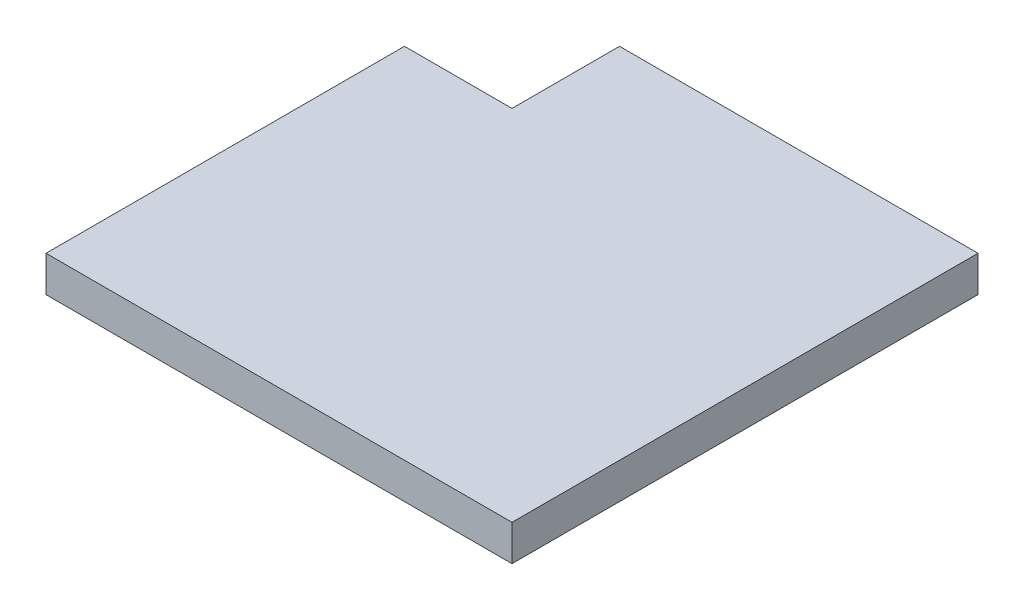
ISO-10303-21;
HEADER;
FILE_DESCRIPTION(('STEP AP214'),'2;1');
FILE_NAME('part.step','',(''),(''),'','','');
FILE_SCHEMA(('AUTOMOTIVE_DESIGN { 1 0 10303 214 1 1 1 1 }'));
ENDSEC;
DATA;
#1=APPLICATION_CONTEXT('core data for automotive mechanical design processes');
#2=APPLICATION_PROTOCOL_DEFINITION('international standard','automotive_design',2000,#1);
#3=PRODUCT_CONTEXT('',#1,'mechanical');
#4=PRODUCT('Part','Part','',(#3));
#5=PRODUCT_RELATED_PRODUCT_CATEGORY('part','',(#4));
#6=PRODUCT_DEFINITION_FORMATION('','',#4);
#7=PRODUCT_DEFINITION_CONTEXT('part definition',#1,'design');
#8=PRODUCT_DEFINITION('design','',#6,#7);
#9=PRODUCT_DEFINITION_SHAPE('','',#8);
#10=(LENGTH_UNIT() NAMED_UNIT(*) SI_UNIT(.MILLI.,.METRE.));
#11=(NAMED_UNIT(*) PLANE_ANGLE_UNIT() SI_UNIT($,.RADIAN.));
#12=(NAMED_UNIT(*) SI_UNIT($,.STERADIAN.) SOLID_ANGLE_UNIT());
#13=UNCERTAINTY_MEASURE_WITH_UNIT(LENGTH_MEASURE(1.E-05),#10,'distance_accuracy_value','');
#14=(GEOMETRIC_REPRESENTATION_CONTEXT(3) GLOBAL_UNCERTAINTY_ASSIGNED_CONTEXT((#13)) GLOBAL_UNIT_ASSIGNED_CONTEXT((#10,
#11,#12)) REPRESENTATION_CONTEXT('',''));
#15=CARTESIAN_POINT('',(0.,0.,0.));
#16=DIRECTION('',(0.,0.,1.));
#17=DIRECTION('',(1.,0.,0.));
#18=AXIS2_PLACEMENT_3D('',#15,#16,#17);
#19=CARTESIAN_POINT('',(65.,10.,65.));
#20=DIRECTION('',(-1.,0.,0.));
#21=DIRECTION('',(0.,0.,1.));
#22=AXIS2_PLACEMENT_3D('',#19,#20,#21);
#23=PLANE('',#22);
#24=DIRECTION('',(0.,0.,-1.));
#25=VECTOR('',#24,1.);
#26=CARTESIAN_POINT('',(65.,0.,65.));
#27=LINE('',#26,#25);
#28=CARTESIAN_POINT('',(65.,0.,65.));
#29=VERTEX_POINT('',#28);
#30=CARTESIAN_POINT('',(65.,0.,-65.));
#31=VERTEX_POINT('',#30);
#32=EDGE_CURVE('E118',#29,#31,#27,.T.);
#33=ORIENTED_EDGE('',*,*,#32,.T.);
#34=DIRECTION('',(0.,-1.,0.));
#35=VECTOR('',#34,1.);
#36=CARTESIAN_POINT('',(65.,10.,-65.));
#37=LINE('',#36,#35);
#38=CARTESIAN_POINT('',(65.,10.,-65.));
#39=VERTEX_POINT('',#38);
#40=EDGE_CURVE('E11',#39,#31,#37,.T.);
#41=ORIENTED_EDGE('',*,*,#40,.F.);
#42=DIRECTION('',(0.,0.,-1.));
#43=VECTOR('',#42,1.);
#44=CARTESIAN_POINT('',(65.,10.,65.));
#45=LINE('',#44,#43);
#46=CARTESIAN_POINT('',(65.,10.,65.));
#47=VERTEX_POINT('',#46);
#48=EDGE_CURVE('E128',#47,#39,#45,.T.);
#49=ORIENTED_EDGE('',*,*,#48,.F.);
#50=DIRECTION('',(0.,-1.,0.));
#51=VECTOR('',#50,1.);
#52=CARTESIAN_POINT('',(65.,10.,65.));
#53=LINE('',#52,#51);
#54=EDGE_CURVE('E114',#47,#29,#53,.T.);
#55=ORIENTED_EDGE('',*,*,#54,.T.);
#56=EDGE_LOOP('',(#33,#41,#49,#55));
#57=FACE_BOUND('',#56,.T.);
#58=ADVANCED_FACE('F34',(#57),#23,.F.);
#59=CARTESIAN_POINT('',(65.,10.,-65.));
#60=DIRECTION('',(0.,0.,1.));
#61=DIRECTION('',(1.,0.,0.));
#62=AXIS2_PLACEMENT_3D('',#59,#60,#61);
#63=PLANE('',#62);
#64=DIRECTION('',(-1.,0.,0.));
#65=VECTOR('',#64,1.);
#66=CARTESIAN_POINT('',(65.,0.,-65.));
#67=LINE('',#66,#65);
#68=CARTESIAN_POINT('',(-35.,0.,-65.));
#69=VERTEX_POINT('',#68);
#70=EDGE_CURVE('E121',#31,#69,#67,.T.);
#71=ORIENTED_EDGE('',*,*,#70,.T.);
#72=DIRECTION('',(0.,-1.,0.));
#73=VECTOR('',#72,1.);
#74=CARTESIAN_POINT('',(-35.,10.,-65.));
#75=LINE('',#74,#73);
#76=CARTESIAN_POINT('',(-35.,10.,-65.));
#77=VERTEX_POINT('',#76);
#78=EDGE_CURVE('E42',#77,#69,#75,.T.);
#79=ORIENTED_EDGE('',*,*,#78,.F.);
#80=DIRECTION('',(-1.,0.,0.));
#81=VECTOR('',#80,1.);
#82=CARTESIAN_POINT('',(65.,10.,-65.));
#83=LINE('',#82,#81);
#84=EDGE_CURVE('E87',#39,#77,#83,.T.);
#85=ORIENTED_EDGE('',*,*,#84,.F.);
#86=ORIENTED_EDGE('',*,*,#40,.T.);
#87=EDGE_LOOP('',(#71,#79,#85,#86));
#88=FACE_BOUND('',#87,.T.);
#89=ADVANCED_FACE('F152',(#88),#63,.F.);
#90=CARTESIAN_POINT('',(-35.,10.,-65.));
#91=DIRECTION('',(1.,0.,0.));
#92=DIRECTION('',(0.,0.,-1.));
#93=AXIS2_PLACEMENT_3D('',#90,#91,#92);
#94=PLANE('',#93);
#95=DIRECTION('',(0.,0.,1.));
#96=VECTOR('',#95,1.);
#97=CARTESIAN_POINT('',(-35.,0.,-65.));
#98=LINE('',#97,#96);
#99=CARTESIAN_POINT('',(-35.,0.,-35.));
#100=VERTEX_POINT('',#99);
#101=EDGE_CURVE('E123',#69,#100,#98,.T.);
#102=ORIENTED_EDGE('',*,*,#101,.T.);
#103=DIRECTION('',(0.,-1.,0.));
#104=VECTOR('',#103,1.);
#105=CARTESIAN_POINT('',(-35.,10.,-35.));
#106=LINE('',#105,#104);
#107=CARTESIAN_POINT('',(-35.,10.,-35.));
#108=VERTEX_POINT('',#107);
#109=EDGE_CURVE('E109',#108,#100,#106,.T.);
#110=ORIENTED_EDGE('',*,*,#109,.F.);
#111=DIRECTION('',(0.,0.,1.));
#112=VECTOR('',#111,1.);
#113=CARTESIAN_POINT('',(-35.,10.,-65.));
#114=LINE('',#113,#112);
#115=EDGE_CURVE('E100',#77,#108,#114,.T.);
#116=ORIENTED_EDGE('',*,*,#115,.F.);
#117=ORIENTED_EDGE('',*,*,#78,.T.);
#118=EDGE_LOOP('',(#102,#110,#116,#117));
#119=FACE_BOUND('',#118,.T.);
#120=ADVANCED_FACE('F134',(#119),#94,.F.);
#121=CARTESIAN_POINT('',(-35.,10.,-35.));
#122=DIRECTION('',(0.,0.,1.));
#123=DIRECTION('',(1.,0.,0.));
#124=AXIS2_PLACEMENT_3D('',#121,#122,#123);
#125=PLANE('',#124);
#126=DIRECTION('',(-1.,0.,0.));
#127=VECTOR('',#126,1.);
#128=CARTESIAN_POINT('',(-35.,0.,-35.));
#129=LINE('',#128,#127);
#130=CARTESIAN_POINT('',(-65.,0.,-35.));
#131=VERTEX_POINT('',#130);
#132=EDGE_CURVE('E108',#100,#131,#129,.T.);
#133=ORIENTED_EDGE('',*,*,#132,.T.);
#134=DIRECTION('',(0.,-1.,0.));
#135=VECTOR('',#134,1.);
#136=CARTESIAN_POINT('',(-65.,10.,-35.));
#137=LINE('',#136,#135);
#138=CARTESIAN_POINT('',(-65.,10.,-35.));
#139=VERTEX_POINT('',#138);
#140=EDGE_CURVE('E105',#139,#131,#137,.T.);
#141=ORIENTED_EDGE('',*,*,#140,.F.);
#142=DIRECTION('',(-1.,0.,0.));
#143=VECTOR('',#142,1.);
#144=CARTESIAN_POINT('',(-35.,10.,-35.));
#145=LINE('',#144,#143);
#146=EDGE_CURVE('E94',#108,#139,#145,.T.);
#147=ORIENTED_EDGE('',*,*,#146,.F.);
#148=ORIENTED_EDGE('',*,*,#109,.T.);
#149=EDGE_LOOP('',(#133,#141,#147,#148));
#150=FACE_BOUND('',#149,.T.);
#151=ADVANCED_FACE('F106',(#150),#125,.F.);
#152=CARTESIAN_POINT('',(-65.,10.,-35.));
#153=DIRECTION('',(1.,0.,0.));
#154=DIRECTION('',(0.,0.,-1.));
#155=AXIS2_PLACEMENT_3D('',#152,#153,#154);
#156=PLANE('',#155);
#157=DIRECTION('',(0.,0.,1.));
#158=VECTOR('',#157,1.);
#159=CARTESIAN_POINT('',(-65.,0.,-35.));
#160=LINE('',#159,#158);
#161=CARTESIAN_POINT('',(-65.,0.,65.));
#162=VERTEX_POINT('',#161);
#163=EDGE_CURVE('E73',#131,#162,#160,.T.);
#164=ORIENTED_EDGE('',*,*,#163,.T.);
#165=DIRECTION('',(0.,-1.,0.));
#166=VECTOR('',#165,1.);
#167=CARTESIAN_POINT('',(-65.,10.,65.));
#168=LINE('',#167,#166);
#169=CARTESIAN_POINT('',(-65.,10.,65.));
#170=VERTEX_POINT('',#169);
#171=EDGE_CURVE('E110',#170,#162,#168,.T.);
#172=ORIENTED_EDGE('',*,*,#171,.F.);
#173=DIRECTION('',(0.,0.,1.));
#174=VECTOR('',#173,1.);
#175=CARTESIAN_POINT('',(-65.,10.,-35.));
#176=LINE('',#175,#174);
#177=EDGE_CURVE('E98',#139,#170,#176,.T.);
#178=ORIENTED_EDGE('',*,*,#177,.F.);
#179=ORIENTED_EDGE('',*,*,#140,.T.);
#180=EDGE_LOOP('',(#164,#172,#178,#179));
#181=FACE_BOUND('',#180,.T.);
#182=ADVANCED_FACE('F112',(#181),#156,.F.);
#183=CARTESIAN_POINT('',(-65.,10.,65.));
#184=DIRECTION('',(0.,0.,-1.));
#185=DIRECTION('',(-1.,0.,0.));
#186=AXIS2_PLACEMENT_3D('',#183,#184,#185);
#187=PLANE('',#186);
#188=DIRECTION('',(1.,0.,0.));
#189=VECTOR('',#188,1.);
#190=CARTESIAN_POINT('',(-65.,0.,65.));
#191=LINE('',#190,#189);
#192=EDGE_CURVE('E79',#162,#29,#191,.T.);
#193=ORIENTED_EDGE('',*,*,#192,.T.);
#194=ORIENTED_EDGE('',*,*,#54,.F.);
#195=DIRECTION('',(1.,0.,0.));
#196=VECTOR('',#195,1.);
#197=CARTESIAN_POINT('',(-65.,10.,65.));
#198=LINE('',#197,#196);
#199=EDGE_CURVE('E50',#170,#47,#198,.T.);
#200=ORIENTED_EDGE('',*,*,#199,.F.);
#201=ORIENTED_EDGE('',*,*,#171,.T.);
#202=EDGE_LOOP('',(#193,#194,#200,#201));
#203=FACE_BOUND('',#202,.T.);
#204=ADVANCED_FACE('F141',(#203),#187,.F.);
#205=CARTESIAN_POINT('',(0.,10.,0.));
#206=DIRECTION('',(0.,1.,0.));
#207=DIRECTION('',(0.,0.,1.));
#208=AXIS2_PLACEMENT_3D('',#205,#206,#207);
#209=PLANE('',#208);
#210=ORIENTED_EDGE('',*,*,#48,.T.);
#211=ORIENTED_EDGE('',*,*,#84,.T.);
#212=ORIENTED_EDGE('',*,*,#115,.T.);
#213=ORIENTED_EDGE('',*,*,#146,.T.);
#214=ORIENTED_EDGE('',*,*,#177,.T.);
#215=ORIENTED_EDGE('',*,*,#199,.T.);
#216=EDGE_LOOP('',(#210,#211,#212,#213,#214,#215));
#217=FACE_BOUND('',#216,.T.);
#218=ADVANCED_FACE('F96',(#217),#209,.T.);
#219=CARTESIAN_POINT('',(0.,0.,0.));
#220=DIRECTION('',(0.,1.,0.));
#221=DIRECTION('',(0.,0.,1.));
#222=AXIS2_PLACEMENT_3D('',#219,#220,#221);
#223=PLANE('',#222);
#224=ORIENTED_EDGE('',*,*,#32,.F.);
#225=ORIENTED_EDGE('',*,*,#192,.F.);
#226=ORIENTED_EDGE('',*,*,#163,.F.);
#227=ORIENTED_EDGE('',*,*,#132,.F.);
#228=ORIENTED_EDGE('',*,*,#101,.F.);
#229=ORIENTED_EDGE('',*,*,#70,.F.);
#230=EDGE_LOOP('',(#224,#225,#226,#227,#228,#229));
#231=FACE_BOUND('',#230,.T.);
#232=ADVANCED_FACE('F137',(#231),#223,.F.);
#233=CLOSED_SHELL('',(#58,#89,#120,#151,#182,#204,#218,#232));
#234=MANIFOLD_SOLID_BREP('B2',#233);
#235=ADVANCED_BREP_SHAPE_REPRESENTATION('',(#18,#234),#14);
#236=SHAPE_DEFINITION_REPRESENTATION(#9,#235);
ENDSEC;
END-ISO-10303-21;
